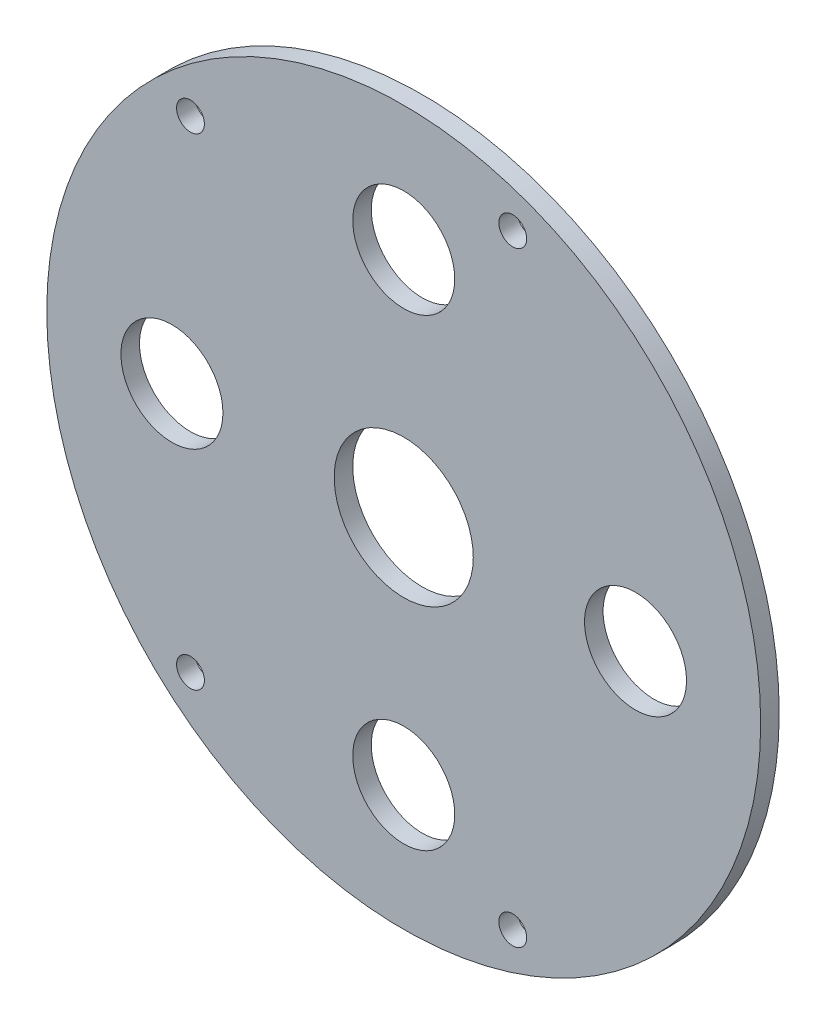
ISO-10303-21;
HEADER;
FILE_DESCRIPTION(('STEP AP214'),'2;1');
FILE_NAME('part.step','',(''),(''),'','','');
FILE_SCHEMA(('AUTOMOTIVE_DESIGN { 1 0 10303 214 1 1 1 1 }'));
ENDSEC;
DATA;
#1=APPLICATION_CONTEXT('core data for automotive mechanical design processes');
#2=APPLICATION_PROTOCOL_DEFINITION('international standard','automotive_design',2000,#1);
#3=PRODUCT_CONTEXT('',#1,'mechanical');
#4=PRODUCT('Part','Part','',(#3));
#5=PRODUCT_RELATED_PRODUCT_CATEGORY('part','',(#4));
#6=PRODUCT_DEFINITION_FORMATION('','',#4);
#7=PRODUCT_DEFINITION_CONTEXT('part definition',#1,'design');
#8=PRODUCT_DEFINITION('design','',#6,#7);
#9=PRODUCT_DEFINITION_SHAPE('','',#8);
#10=(LENGTH_UNIT() NAMED_UNIT(*) SI_UNIT(.MILLI.,.METRE.));
#11=(NAMED_UNIT(*) PLANE_ANGLE_UNIT() SI_UNIT($,.RADIAN.));
#12=(NAMED_UNIT(*) SI_UNIT($,.STERADIAN.) SOLID_ANGLE_UNIT());
#13=UNCERTAINTY_MEASURE_WITH_UNIT(LENGTH_MEASURE(1.E-05),#10,'distance_accuracy_value','');
#14=(GEOMETRIC_REPRESENTATION_CONTEXT(3) GLOBAL_UNCERTAINTY_ASSIGNED_CONTEXT((#13)) GLOBAL_UNIT_ASSIGNED_CONTEXT((#10,
#11,#12)) REPRESENTATION_CONTEXT('',''));
#15=CARTESIAN_POINT('',(0.,0.,0.));
#16=DIRECTION('',(0.,0.,1.));
#17=DIRECTION('',(1.,0.,0.));
#18=AXIS2_PLACEMENT_3D('',#15,#16,#17);
#19=CARTESIAN_POINT('',(0.,0.,2.));
#20=DIRECTION('',(0.,0.,1.));
#21=DIRECTION('',(1.,0.,0.));
#22=AXIS2_PLACEMENT_3D('',#19,#20,#21);
#23=PLANE('',#22);
#24=CARTESIAN_POINT('',(25.0000000000004,0.,2.));
#25=DIRECTION('',(0.,0.,1.));
#26=DIRECTION('',(1.,0.,0.));
#27=AXIS2_PLACEMENT_3D('',#24,#25,#26);
#28=CIRCLE('',#27,5.50000000000006);
#29=CARTESIAN_POINT('',(30.5000000000004,0.,2.));
#30=VERTEX_POINT('',#29);
#31=EDGE_CURVE('E82',#30,#30,#28,.T.);
#32=ORIENTED_EDGE('',*,*,#31,.F.);
#33=EDGE_LOOP('',(#32));
#34=FACE_BOUND('',#33,.T.);
#35=CARTESIAN_POINT('',(0.,24.9999999999999,2.));
#36=DIRECTION('',(0.,0.,1.));
#37=DIRECTION('',(1.,0.,0.));
#38=AXIS2_PLACEMENT_3D('',#35,#36,#37);
#39=CIRCLE('',#38,5.50000000000006);
#40=CARTESIAN_POINT('',(5.50000000000006,24.9999999999999,2.));
#41=VERTEX_POINT('',#40);
#42=EDGE_CURVE('E70',#41,#41,#39,.T.);
#43=ORIENTED_EDGE('',*,*,#42,.F.);
#44=EDGE_LOOP('',(#43));
#45=FACE_BOUND('',#44,.T.);
#46=CARTESIAN_POINT('',(-23.,-25.98,2.));
#47=DIRECTION('',(0.,0.,1.));
#48=DIRECTION('',(1.,0.,0.));
#49=AXIS2_PLACEMENT_3D('',#46,#47,#48);
#50=CIRCLE('',#49,1.50000000000006);
#51=CARTESIAN_POINT('',(-21.4999999999999,-25.98,2.));
#52=VERTEX_POINT('',#51);
#53=EDGE_CURVE('E58',#52,#52,#50,.T.);
#54=ORIENTED_EDGE('',*,*,#53,.F.);
#55=EDGE_LOOP('',(#54));
#56=FACE_BOUND('',#55,.T.);
#57=CARTESIAN_POINT('',(11.7571445448976,-32.6461261430855,2.));
#58=DIRECTION('',(0.,0.,1.));
#59=DIRECTION('',(1.,0.,0.));
#60=AXIS2_PLACEMENT_3D('',#57,#58,#59);
#61=CIRCLE('',#60,1.50000000000006);
#62=CARTESIAN_POINT('',(13.2571445448977,-32.6461261430855,2.));
#63=VERTEX_POINT('',#62);
#64=EDGE_CURVE('E46',#63,#63,#61,.T.);
#65=ORIENTED_EDGE('',*,*,#64,.F.);
#66=EDGE_LOOP('',(#65));
#67=FACE_BOUND('',#66,.T.);
#68=CARTESIAN_POINT('',(0.,0.,2.));
#69=DIRECTION('',(0.,0.,1.));
#70=DIRECTION('',(1.,0.,0.));
#71=AXIS2_PLACEMENT_3D('',#68,#69,#70);
#72=CIRCLE('',#71,38.5);
#73=CARTESIAN_POINT('',(38.5,0.,2.));
#74=VERTEX_POINT('',#73);
#75=EDGE_CURVE('E10',#74,#74,#72,.T.);
#76=ORIENTED_EDGE('',*,*,#75,.T.);
#77=EDGE_LOOP('',(#76));
#78=FACE_BOUND('',#77,.T.);
#79=CARTESIAN_POINT('',(-23.,25.98,2.));
#80=DIRECTION('',(0.,0.,1.));
#81=DIRECTION('',(1.,0.,0.));
#82=AXIS2_PLACEMENT_3D('',#79,#80,#81);
#83=CIRCLE('',#82,1.50000000000006);
#84=CARTESIAN_POINT('',(-21.4999999999999,25.98,2.));
#85=VERTEX_POINT('',#84);
#86=EDGE_CURVE('E41',#85,#85,#83,.T.);
#87=ORIENTED_EDGE('',*,*,#86,.F.);
#88=EDGE_LOOP('',(#87));
#89=FACE_BOUND('',#88,.T.);
#90=CARTESIAN_POINT('',(11.7571445448976,32.6461261430859,2.));
#91=DIRECTION('',(0.,0.,1.));
#92=DIRECTION('',(1.,0.,0.));
#93=AXIS2_PLACEMENT_3D('',#90,#91,#92);
#94=CIRCLE('',#93,1.50000000000006);
#95=CARTESIAN_POINT('',(13.2571445448977,32.6461261430859,2.));
#96=VERTEX_POINT('',#95);
#97=EDGE_CURVE('E52',#96,#96,#94,.T.);
#98=ORIENTED_EDGE('',*,*,#97,.F.);
#99=EDGE_LOOP('',(#98));
#100=FACE_BOUND('',#99,.T.);
#101=CARTESIAN_POINT('',(-24.9999999999999,0.,2.));
#102=DIRECTION('',(0.,0.,1.));
#103=DIRECTION('',(1.,0.,0.));
#104=AXIS2_PLACEMENT_3D('',#101,#102,#103);
#105=CIRCLE('',#104,5.50000000000006);
#106=CARTESIAN_POINT('',(-19.4999999999999,0.,2.));
#107=VERTEX_POINT('',#106);
#108=EDGE_CURVE('E64',#107,#107,#105,.T.);
#109=ORIENTED_EDGE('',*,*,#108,.F.);
#110=EDGE_LOOP('',(#109));
#111=FACE_BOUND('',#110,.T.);
#112=CARTESIAN_POINT('',(0.,-25.0000000000001,2.));
#113=DIRECTION('',(0.,0.,1.));
#114=DIRECTION('',(1.,0.,0.));
#115=AXIS2_PLACEMENT_3D('',#112,#113,#114);
#116=CIRCLE('',#115,5.50000000000006);
#117=CARTESIAN_POINT('',(5.50000000000006,-25.0000000000001,2.));
#118=VERTEX_POINT('',#117);
#119=EDGE_CURVE('E76',#118,#118,#116,.T.);
#120=ORIENTED_EDGE('',*,*,#119,.F.);
#121=EDGE_LOOP('',(#120));
#122=FACE_BOUND('',#121,.T.);
#123=CARTESIAN_POINT('',(0.,0.,2.));
#124=DIRECTION('',(0.,0.,1.));
#125=DIRECTION('',(1.,0.,0.));
#126=AXIS2_PLACEMENT_3D('',#123,#124,#125);
#127=CIRCLE('',#126,7.49999999999984);
#128=CARTESIAN_POINT('',(7.49999999999984,0.,2.));
#129=VERTEX_POINT('',#128);
#130=EDGE_CURVE('E88',#129,#129,#127,.T.);
#131=ORIENTED_EDGE('',*,*,#130,.F.);
#132=EDGE_LOOP('',(#131));
#133=FACE_BOUND('',#132,.T.);
#134=ADVANCED_FACE('F30',(#34,#45,#56,#67,#78,#89,#100,#111,#122,#133),#23,.T.);
#135=CARTESIAN_POINT('',(0.,0.,0.));
#136=DIRECTION('',(0.,0.,1.));
#137=DIRECTION('',(1.,0.,0.));
#138=AXIS2_PLACEMENT_3D('',#135,#136,#137);
#139=PLANE('',#138);
#140=CARTESIAN_POINT('',(25.0000000000004,0.,0.));
#141=DIRECTION('',(0.,0.,1.));
#142=DIRECTION('',(1.,0.,0.));
#143=AXIS2_PLACEMENT_3D('',#140,#141,#142);
#144=CIRCLE('',#143,5.50000000000006);
#145=CARTESIAN_POINT('',(30.5000000000004,0.,0.));
#146=VERTEX_POINT('',#145);
#147=EDGE_CURVE('E85',#146,#146,#144,.T.);
#148=ORIENTED_EDGE('',*,*,#147,.T.);
#149=EDGE_LOOP('',(#148));
#150=FACE_BOUND('',#149,.T.);
#151=CARTESIAN_POINT('',(0.,24.9999999999999,0.));
#152=DIRECTION('',(0.,0.,1.));
#153=DIRECTION('',(1.,0.,0.));
#154=AXIS2_PLACEMENT_3D('',#151,#152,#153);
#155=CIRCLE('',#154,5.50000000000006);
#156=CARTESIAN_POINT('',(5.50000000000006,24.9999999999999,0.));
#157=VERTEX_POINT('',#156);
#158=EDGE_CURVE('E73',#157,#157,#155,.T.);
#159=ORIENTED_EDGE('',*,*,#158,.T.);
#160=EDGE_LOOP('',(#159));
#161=FACE_BOUND('',#160,.T.);
#162=CARTESIAN_POINT('',(-23.,-25.98,0.));
#163=DIRECTION('',(0.,0.,1.));
#164=DIRECTION('',(1.,0.,0.));
#165=AXIS2_PLACEMENT_3D('',#162,#163,#164);
#166=CIRCLE('',#165,1.50000000000006);
#167=CARTESIAN_POINT('',(-21.4999999999999,-25.98,0.));
#168=VERTEX_POINT('',#167);
#169=EDGE_CURVE('E61',#168,#168,#166,.T.);
#170=ORIENTED_EDGE('',*,*,#169,.T.);
#171=EDGE_LOOP('',(#170));
#172=FACE_BOUND('',#171,.T.);
#173=CARTESIAN_POINT('',(11.7571445448976,-32.6461261430855,0.));
#174=DIRECTION('',(0.,0.,1.));
#175=DIRECTION('',(1.,0.,0.));
#176=AXIS2_PLACEMENT_3D('',#173,#174,#175);
#177=CIRCLE('',#176,1.50000000000006);
#178=CARTESIAN_POINT('',(13.2571445448977,-32.6461261430855,0.));
#179=VERTEX_POINT('',#178);
#180=EDGE_CURVE('E49',#179,#179,#177,.T.);
#181=ORIENTED_EDGE('',*,*,#180,.T.);
#182=EDGE_LOOP('',(#181));
#183=FACE_BOUND('',#182,.T.);
#184=CARTESIAN_POINT('',(0.,0.,0.));
#185=DIRECTION('',(0.,0.,1.));
#186=DIRECTION('',(1.,0.,0.));
#187=AXIS2_PLACEMENT_3D('',#184,#185,#186);
#188=CIRCLE('',#187,38.5);
#189=CARTESIAN_POINT('',(38.5,0.,0.));
#190=VERTEX_POINT('',#189);
#191=EDGE_CURVE('E34',#190,#190,#188,.T.);
#192=ORIENTED_EDGE('',*,*,#191,.F.);
#193=EDGE_LOOP('',(#192));
#194=FACE_BOUND('',#193,.T.);
#195=CARTESIAN_POINT('',(-23.,25.98,0.));
#196=DIRECTION('',(0.,0.,1.));
#197=DIRECTION('',(1.,0.,0.));
#198=AXIS2_PLACEMENT_3D('',#195,#196,#197);
#199=CIRCLE('',#198,1.50000000000006);
#200=CARTESIAN_POINT('',(-21.4999999999999,25.98,0.));
#201=VERTEX_POINT('',#200);
#202=EDGE_CURVE('E43',#201,#201,#199,.T.);
#203=ORIENTED_EDGE('',*,*,#202,.T.);
#204=EDGE_LOOP('',(#203));
#205=FACE_BOUND('',#204,.T.);
#206=CARTESIAN_POINT('',(11.7571445448976,32.6461261430859,0.));
#207=DIRECTION('',(0.,0.,1.));
#208=DIRECTION('',(1.,0.,0.));
#209=AXIS2_PLACEMENT_3D('',#206,#207,#208);
#210=CIRCLE('',#209,1.50000000000006);
#211=CARTESIAN_POINT('',(13.2571445448977,32.6461261430859,0.));
#212=VERTEX_POINT('',#211);
#213=EDGE_CURVE('E55',#212,#212,#210,.T.);
#214=ORIENTED_EDGE('',*,*,#213,.T.);
#215=EDGE_LOOP('',(#214));
#216=FACE_BOUND('',#215,.T.);
#217=CARTESIAN_POINT('',(-24.9999999999999,0.,0.));
#218=DIRECTION('',(0.,0.,1.));
#219=DIRECTION('',(1.,0.,0.));
#220=AXIS2_PLACEMENT_3D('',#217,#218,#219);
#221=CIRCLE('',#220,5.50000000000006);
#222=CARTESIAN_POINT('',(-19.4999999999999,0.,0.));
#223=VERTEX_POINT('',#222);
#224=EDGE_CURVE('E67',#223,#223,#221,.T.);
#225=ORIENTED_EDGE('',*,*,#224,.T.);
#226=EDGE_LOOP('',(#225));
#227=FACE_BOUND('',#226,.T.);
#228=CARTESIAN_POINT('',(0.,-25.0000000000001,0.));
#229=DIRECTION('',(0.,0.,1.));
#230=DIRECTION('',(1.,0.,0.));
#231=AXIS2_PLACEMENT_3D('',#228,#229,#230);
#232=CIRCLE('',#231,5.50000000000006);
#233=CARTESIAN_POINT('',(5.50000000000006,-25.0000000000001,0.));
#234=VERTEX_POINT('',#233);
#235=EDGE_CURVE('E79',#234,#234,#232,.T.);
#236=ORIENTED_EDGE('',*,*,#235,.T.);
#237=EDGE_LOOP('',(#236));
#238=FACE_BOUND('',#237,.T.);
#239=CARTESIAN_POINT('',(0.,0.,0.));
#240=DIRECTION('',(0.,0.,1.));
#241=DIRECTION('',(1.,0.,0.));
#242=AXIS2_PLACEMENT_3D('',#239,#240,#241);
#243=CIRCLE('',#242,7.49999999999984);
#244=CARTESIAN_POINT('',(7.49999999999984,0.,0.));
#245=VERTEX_POINT('',#244);
#246=EDGE_CURVE('E91',#245,#245,#243,.T.);
#247=ORIENTED_EDGE('',*,*,#246,.T.);
#248=EDGE_LOOP('',(#247));
#249=FACE_BOUND('',#248,.T.);
#250=ADVANCED_FACE('F101',(#150,#161,#172,#183,#194,#205,#216,#227,#238,#249),#139,.F.);
#251=CARTESIAN_POINT('',(0.,0.,2.));
#252=DIRECTION('',(0.,0.,-1.));
#253=DIRECTION('',(-1.,0.,0.));
#254=AXIS2_PLACEMENT_3D('',#251,#252,#253);
#255=CYLINDRICAL_SURFACE('',#254,38.5);
#256=ORIENTED_EDGE('',*,*,#75,.F.);
#257=EDGE_LOOP('',(#256));
#258=FACE_BOUND('',#257,.T.);
#259=ORIENTED_EDGE('',*,*,#191,.T.);
#260=EDGE_LOOP('',(#259));
#261=FACE_BOUND('',#260,.T.);
#262=ADVANCED_FACE('F32',(#258,#261),#255,.T.);
#263=CARTESIAN_POINT('',(-23.,25.98,2.));
#264=DIRECTION('',(0.,0.,-1.));
#265=DIRECTION('',(-1.,0.,0.));
#266=AXIS2_PLACEMENT_3D('',#263,#264,#265);
#267=CYLINDRICAL_SURFACE('',#266,1.50000000000006);
#268=ORIENTED_EDGE('',*,*,#86,.T.);
#269=EDGE_LOOP('',(#268));
#270=FACE_BOUND('',#269,.T.);
#271=ORIENTED_EDGE('',*,*,#202,.F.);
#272=EDGE_LOOP('',(#271));
#273=FACE_BOUND('',#272,.T.);
#274=ADVANCED_FACE('F111',(#270,#273),#267,.F.);
#275=CARTESIAN_POINT('',(11.7571445448976,-32.6461261430855,2.));
#276=DIRECTION('',(0.,0.,-1.));
#277=DIRECTION('',(-1.,0.,0.));
#278=AXIS2_PLACEMENT_3D('',#275,#276,#277);
#279=CYLINDRICAL_SURFACE('',#278,1.50000000000006);
#280=ORIENTED_EDGE('',*,*,#64,.T.);
#281=EDGE_LOOP('',(#280));
#282=FACE_BOUND('',#281,.T.);
#283=ORIENTED_EDGE('',*,*,#180,.F.);
#284=EDGE_LOOP('',(#283));
#285=FACE_BOUND('',#284,.T.);
#286=ADVANCED_FACE('F114',(#282,#285),#279,.F.);
#287=CARTESIAN_POINT('',(11.7571445448976,32.6461261430859,2.));
#288=DIRECTION('',(0.,0.,-1.));
#289=DIRECTION('',(-1.,0.,0.));
#290=AXIS2_PLACEMENT_3D('',#287,#288,#289);
#291=CYLINDRICAL_SURFACE('',#290,1.50000000000006);
#292=ORIENTED_EDGE('',*,*,#97,.T.);
#293=EDGE_LOOP('',(#292));
#294=FACE_BOUND('',#293,.T.);
#295=ORIENTED_EDGE('',*,*,#213,.F.);
#296=EDGE_LOOP('',(#295));
#297=FACE_BOUND('',#296,.T.);
#298=ADVANCED_FACE('F118',(#294,#297),#291,.F.);
#299=CARTESIAN_POINT('',(-23.,-25.98,2.));
#300=DIRECTION('',(0.,0.,-1.));
#301=DIRECTION('',(-1.,0.,0.));
#302=AXIS2_PLACEMENT_3D('',#299,#300,#301);
#303=CYLINDRICAL_SURFACE('',#302,1.50000000000006);
#304=ORIENTED_EDGE('',*,*,#53,.T.);
#305=EDGE_LOOP('',(#304));
#306=FACE_BOUND('',#305,.T.);
#307=ORIENTED_EDGE('',*,*,#169,.F.);
#308=EDGE_LOOP('',(#307));
#309=FACE_BOUND('',#308,.T.);
#310=ADVANCED_FACE('F122',(#306,#309),#303,.F.);
#311=CARTESIAN_POINT('',(-24.9999999999999,0.,2.));
#312=DIRECTION('',(0.,0.,-1.));
#313=DIRECTION('',(-1.,0.,0.));
#314=AXIS2_PLACEMENT_3D('',#311,#312,#313);
#315=CYLINDRICAL_SURFACE('',#314,5.50000000000006);
#316=ORIENTED_EDGE('',*,*,#108,.T.);
#317=EDGE_LOOP('',(#316));
#318=FACE_BOUND('',#317,.T.);
#319=ORIENTED_EDGE('',*,*,#224,.F.);
#320=EDGE_LOOP('',(#319));
#321=FACE_BOUND('',#320,.T.);
#322=ADVANCED_FACE('F126',(#318,#321),#315,.F.);
#323=CARTESIAN_POINT('',(0.,24.9999999999999,2.));
#324=DIRECTION('',(0.,0.,-1.));
#325=DIRECTION('',(-1.,0.,0.));
#326=AXIS2_PLACEMENT_3D('',#323,#324,#325);
#327=CYLINDRICAL_SURFACE('',#326,5.50000000000006);
#328=ORIENTED_EDGE('',*,*,#42,.T.);
#329=EDGE_LOOP('',(#328));
#330=FACE_BOUND('',#329,.T.);
#331=ORIENTED_EDGE('',*,*,#158,.F.);
#332=EDGE_LOOP('',(#331));
#333=FACE_BOUND('',#332,.T.);
#334=ADVANCED_FACE('F130',(#330,#333),#327,.F.);
#335=CARTESIAN_POINT('',(0.,-25.0000000000001,2.));
#336=DIRECTION('',(0.,0.,-1.));
#337=DIRECTION('',(-1.,0.,0.));
#338=AXIS2_PLACEMENT_3D('',#335,#336,#337);
#339=CYLINDRICAL_SURFACE('',#338,5.50000000000006);
#340=ORIENTED_EDGE('',*,*,#119,.T.);
#341=EDGE_LOOP('',(#340));
#342=FACE_BOUND('',#341,.T.);
#343=ORIENTED_EDGE('',*,*,#235,.F.);
#344=EDGE_LOOP('',(#343));
#345=FACE_BOUND('',#344,.T.);
#346=ADVANCED_FACE('F134',(#342,#345),#339,.F.);
#347=CARTESIAN_POINT('',(25.0000000000004,0.,2.));
#348=DIRECTION('',(0.,0.,-1.));
#349=DIRECTION('',(-1.,0.,0.));
#350=AXIS2_PLACEMENT_3D('',#347,#348,#349);
#351=CYLINDRICAL_SURFACE('',#350,5.50000000000006);
#352=ORIENTED_EDGE('',*,*,#31,.T.);
#353=EDGE_LOOP('',(#352));
#354=FACE_BOUND('',#353,.T.);
#355=ORIENTED_EDGE('',*,*,#147,.F.);
#356=EDGE_LOOP('',(#355));
#357=FACE_BOUND('',#356,.T.);
#358=ADVANCED_FACE('F138',(#354,#357),#351,.F.);
#359=CARTESIAN_POINT('',(0.,0.,2.));
#360=DIRECTION('',(0.,0.,-1.));
#361=DIRECTION('',(-1.,0.,0.));
#362=AXIS2_PLACEMENT_3D('',#359,#360,#361);
#363=CYLINDRICAL_SURFACE('',#362,7.49999999999984);
#364=ORIENTED_EDGE('',*,*,#130,.T.);
#365=EDGE_LOOP('',(#364));
#366=FACE_BOUND('',#365,.T.);
#367=ORIENTED_EDGE('',*,*,#246,.F.);
#368=EDGE_LOOP('',(#367));
#369=FACE_BOUND('',#368,.T.);
#370=ADVANCED_FACE('F97',(#366,#369),#363,.F.);
#371=CLOSED_SHELL('',(#134,#250,#262,#274,#286,#298,#310,#322,#334,#346,#358,#370));
#372=MANIFOLD_SOLID_BREP('B2',#371);
#373=ADVANCED_BREP_SHAPE_REPRESENTATION('',(#18,#372),#14);
#374=SHAPE_DEFINITION_REPRESENTATION(#9,#373);
ENDSEC;
END-ISO-10303-21;
